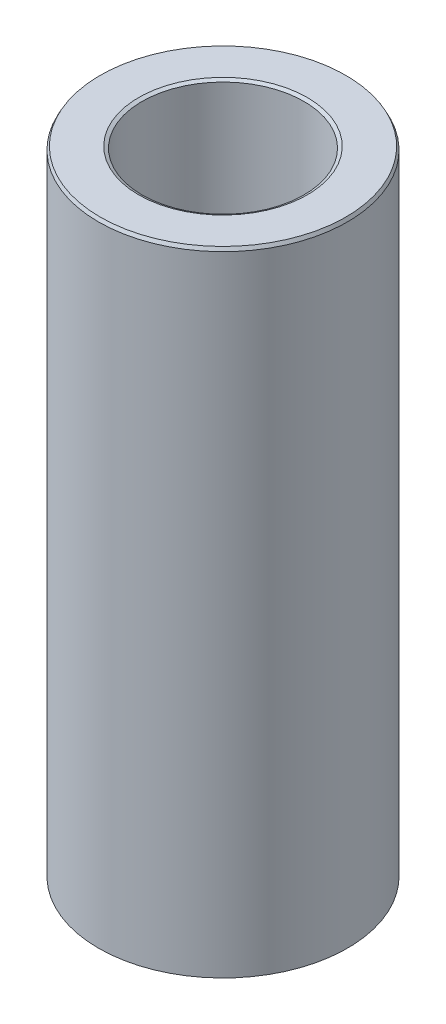
ISO-10303-21;
HEADER;
FILE_DESCRIPTION(('STEP AP214'),'2;1');
FILE_NAME('part.step','',(''),(''),'','','');
FILE_SCHEMA(('AUTOMOTIVE_DESIGN { 1 0 10303 214 1 1 1 1 }'));
ENDSEC;
DATA;
#1=APPLICATION_CONTEXT('core data for automotive mechanical design processes');
#2=APPLICATION_PROTOCOL_DEFINITION('international standard','automotive_design',2000,#1);
#3=PRODUCT_CONTEXT('',#1,'mechanical');
#4=PRODUCT('Part','Part','',(#3));
#5=PRODUCT_RELATED_PRODUCT_CATEGORY('part','',(#4));
#6=PRODUCT_DEFINITION_FORMATION('','',#4);
#7=PRODUCT_DEFINITION_CONTEXT('part definition',#1,'design');
#8=PRODUCT_DEFINITION('design','',#6,#7);
#9=PRODUCT_DEFINITION_SHAPE('','',#8);
#10=(LENGTH_UNIT() NAMED_UNIT(*) SI_UNIT(.MILLI.,.METRE.));
#11=(NAMED_UNIT(*) PLANE_ANGLE_UNIT() SI_UNIT($,.RADIAN.));
#12=(NAMED_UNIT(*) SI_UNIT($,.STERADIAN.) SOLID_ANGLE_UNIT());
#13=UNCERTAINTY_MEASURE_WITH_UNIT(LENGTH_MEASURE(1.E-05),#10,'distance_accuracy_value','');
#14=(GEOMETRIC_REPRESENTATION_CONTEXT(3) GLOBAL_UNCERTAINTY_ASSIGNED_CONTEXT((#13)) GLOBAL_UNIT_ASSIGNED_CONTEXT((#10,
#11,#12)) REPRESENTATION_CONTEXT('',''));
#15=CARTESIAN_POINT('',(0.,0.,0.));
#16=DIRECTION('',(0.,0.,1.));
#17=DIRECTION('',(1.,0.,0.));
#18=AXIS2_PLACEMENT_3D('',#15,#16,#17);
#19=CARTESIAN_POINT('',(0.,152.786120747452,0.));
#20=DIRECTION('',(0.,-1.,0.));
#21=DIRECTION('',(0.,0.,-1.));
#22=AXIS2_PLACEMENT_3D('',#19,#20,#21);
#23=CYLINDRICAL_SURFACE('',#22,30.);
#24=CARTESIAN_POINT('',(0.,0.410165066435625,0.));
#25=DIRECTION('',(0.,1.,0.));
#26=DIRECTION('',(0.,0.,1.));
#27=AXIS2_PLACEMENT_3D('',#24,#25,#26);
#28=CIRCLE('',#27,30.);
#29=CARTESIAN_POINT('',(0.,0.410165066435625,30.));
#30=VERTEX_POINT('',#29);
#31=EDGE_CURVE('E10',#30,#30,#28,.T.);
#32=ORIENTED_EDGE('',*,*,#31,.T.);
#33=EDGE_LOOP('',(#32));
#34=FACE_BOUND('',#33,.T.);
#35=CARTESIAN_POINT('',(0.,151.980294463206,0.));
#36=DIRECTION('',(0.,1.,0.));
#37=DIRECTION('',(0.,0.,1.));
#38=AXIS2_PLACEMENT_3D('',#35,#36,#37);
#39=CIRCLE('',#38,30.);
#40=CARTESIAN_POINT('',(0.,151.980294463206,30.));
#41=VERTEX_POINT('',#40);
#42=EDGE_CURVE('E50',#41,#41,#39,.F.);
#43=ORIENTED_EDGE('',*,*,#42,.T.);
#44=EDGE_LOOP('',(#43));
#45=FACE_BOUND('',#44,.T.);
#46=ADVANCED_FACE('F39',(#34,#45),#23,.T.);
#47=CARTESIAN_POINT('',(0.,152.786120747452,0.));
#48=DIRECTION('',(0.,1.,0.));
#49=DIRECTION('',(0.,0.,1.));
#50=AXIS2_PLACEMENT_3D('',#47,#48,#49);
#51=PLANE('',#50);
#52=CARTESIAN_POINT('',(0.,152.786120747452,0.));
#53=DIRECTION('',(0.,1.,0.));
#54=DIRECTION('',(0.,0.,1.));
#55=AXIS2_PLACEMENT_3D('',#52,#53,#54);
#56=CIRCLE('',#55,20.3250763235816);
#57=CARTESIAN_POINT('',(0.,152.786120747452,20.3250763235816));
#58=VERTEX_POINT('',#57);
#59=EDGE_CURVE('E58',#58,#58,#56,.F.);
#60=ORIENTED_EDGE('',*,*,#59,.T.);
#61=EDGE_LOOP('',(#60));
#62=FACE_BOUND('',#61,.T.);
#63=CARTESIAN_POINT('',(0.,152.786120747452,0.));
#64=DIRECTION('',(0.,1.,0.));
#65=DIRECTION('',(0.,0.,1.));
#66=AXIS2_PLACEMENT_3D('',#63,#64,#65);
#67=CIRCLE('',#66,29.5898349335644);
#68=CARTESIAN_POINT('',(0.,152.786120747452,29.5898349335644));
#69=VERTEX_POINT('',#68);
#70=EDGE_CURVE('E61',#69,#69,#67,.T.);
#71=ORIENTED_EDGE('',*,*,#70,.T.);
#72=EDGE_LOOP('',(#71));
#73=FACE_BOUND('',#72,.T.);
#74=ADVANCED_FACE('F88',(#62,#73),#51,.T.);
#75=CARTESIAN_POINT('',(0.,0.,0.));
#76=DIRECTION('',(0.,1.,0.));
#77=DIRECTION('',(0.,0.,1.));
#78=AXIS2_PLACEMENT_3D('',#75,#76,#77);
#79=PLANE('',#78);
#80=CARTESIAN_POINT('',(0.,0.,0.));
#81=DIRECTION('',(0.,1.,0.));
#82=DIRECTION('',(0.,0.,1.));
#83=AXIS2_PLACEMENT_3D('',#80,#81,#82);
#84=CIRCLE('',#83,19.9294151057713);
#85=CARTESIAN_POINT('',(0.,0.,19.9294151057713));
#86=VERTEX_POINT('',#85);
#87=EDGE_CURVE('E51',#86,#86,#84,.T.);
#88=ORIENTED_EDGE('',*,*,#87,.T.);
#89=EDGE_LOOP('',(#88));
#90=FACE_BOUND('',#89,.T.);
#91=CARTESIAN_POINT('',(0.,0.,0.));
#92=DIRECTION('',(0.,1.,0.));
#93=DIRECTION('',(0.,0.,1.));
#94=AXIS2_PLACEMENT_3D('',#91,#92,#93);
#95=CIRCLE('',#94,29.1941737157541);
#96=CARTESIAN_POINT('',(0.,0.,29.1941737157541));
#97=VERTEX_POINT('',#96);
#98=EDGE_CURVE('E54',#97,#97,#95,.F.);
#99=ORIENTED_EDGE('',*,*,#98,.T.);
#100=EDGE_LOOP('',(#99));
#101=FACE_BOUND('',#100,.T.);
#102=ADVANCED_FACE('F83',(#90,#101),#79,.F.);
#103=CARTESIAN_POINT('',(0.,152.786120747452,0.));
#104=DIRECTION('',(0.,-1.,0.));
#105=DIRECTION('',(0.,0.,-1.));
#106=AXIS2_PLACEMENT_3D('',#103,#104,#105);
#107=CYLINDRICAL_SURFACE('',#106,19.5192500393356);
#108=CARTESIAN_POINT('',(0.,152.375955681016,0.));
#109=DIRECTION('',(0.,1.,0.));
#110=DIRECTION('',(0.,0.,1.));
#111=AXIS2_PLACEMENT_3D('',#108,#109,#110);
#112=CIRCLE('',#111,19.5192500393356);
#113=CARTESIAN_POINT('',(0.,152.375955681016,19.5192500393356));
#114=VERTEX_POINT('',#113);
#115=EDGE_CURVE('E67',#114,#114,#112,.T.);
#116=ORIENTED_EDGE('',*,*,#115,.T.);
#117=EDGE_LOOP('',(#116));
#118=FACE_BOUND('',#117,.T.);
#119=CARTESIAN_POINT('',(0.,0.805826284245942,0.));
#120=DIRECTION('',(0.,1.,0.));
#121=DIRECTION('',(0.,0.,1.));
#122=AXIS2_PLACEMENT_3D('',#119,#120,#121);
#123=CIRCLE('',#122,19.5192500393356);
#124=CARTESIAN_POINT('',(0.,0.805826284245942,19.5192500393356));
#125=VERTEX_POINT('',#124);
#126=EDGE_CURVE('E69',#125,#125,#123,.F.);
#127=ORIENTED_EDGE('',*,*,#126,.T.);
#128=EDGE_LOOP('',(#127));
#129=FACE_BOUND('',#128,.T.);
#130=ADVANCED_FACE('F71',(#118,#129),#107,.F.);
#131=CARTESIAN_POINT('',(0.,152.375955681016,0.));
#132=DIRECTION('',(0.,1.,0.));
#133=DIRECTION('',(0.,0.,1.));
#134=AXIS2_PLACEMENT_3D('',#131,#132,#133);
#135=CONICAL_SURFACE('',#134,19.5192500393356,1.09997517276918);
#136=ORIENTED_EDGE('',*,*,#59,.F.);
#137=EDGE_LOOP('',(#136));
#138=FACE_BOUND('',#137,.T.);
#139=ORIENTED_EDGE('',*,*,#115,.F.);
#140=EDGE_LOOP('',(#139));
#141=FACE_BOUND('',#140,.T.);
#142=ADVANCED_FACE('F77',(#138,#141),#135,.F.);
#143=CARTESIAN_POINT('',(0.,0.,0.));
#144=DIRECTION('',(0.,-1.,0.));
#145=DIRECTION('',(0.,0.,-1.));
#146=AXIS2_PLACEMENT_3D('',#143,#144,#145);
#147=CONICAL_SURFACE('',#146,19.9294151057713,0.470821154025729);
#148=ORIENTED_EDGE('',*,*,#126,.F.);
#149=EDGE_LOOP('',(#148));
#150=FACE_BOUND('',#149,.T.);
#151=ORIENTED_EDGE('',*,*,#87,.F.);
#152=EDGE_LOOP('',(#151));
#153=FACE_BOUND('',#152,.T.);
#154=ADVANCED_FACE('F73',(#150,#153),#147,.F.);
#155=CARTESIAN_POINT('',(0.,0.410165066435625,0.));
#156=DIRECTION('',(0.,1.,0.));
#157=DIRECTION('',(0.,0.,1.));
#158=AXIS2_PLACEMENT_3D('',#155,#156,#157);
#159=CONICAL_SURFACE('',#158,30.,1.09997517276917);
#160=ORIENTED_EDGE('',*,*,#98,.F.);
#161=EDGE_LOOP('',(#160));
#162=FACE_BOUND('',#161,.T.);
#163=ORIENTED_EDGE('',*,*,#31,.F.);
#164=EDGE_LOOP('',(#163));
#165=FACE_BOUND('',#164,.T.);
#166=ADVANCED_FACE('F76',(#162,#165),#159,.T.);
#167=CARTESIAN_POINT('',(0.,152.786120747452,0.));
#168=DIRECTION('',(0.,-1.,0.));
#169=DIRECTION('',(0.,0.,-1.));
#170=AXIS2_PLACEMENT_3D('',#167,#168,#169);
#171=CONICAL_SURFACE('',#170,29.5898349335644,0.470821154025708);
#172=ORIENTED_EDGE('',*,*,#42,.F.);
#173=EDGE_LOOP('',(#172));
#174=FACE_BOUND('',#173,.T.);
#175=ORIENTED_EDGE('',*,*,#70,.F.);
#176=EDGE_LOOP('',(#175));
#177=FACE_BOUND('',#176,.T.);
#178=ADVANCED_FACE('F45',(#174,#177),#171,.T.);
#179=CLOSED_SHELL('',(#46,#74,#102,#130,#142,#154,#166,#178));
#180=MANIFOLD_SOLID_BREP('B2',#179);
#181=ADVANCED_BREP_SHAPE_REPRESENTATION('',(#18,#180),#14);
#182=SHAPE_DEFINITION_REPRESENTATION(#9,#181);
ENDSEC;
END-ISO-10303-21;
